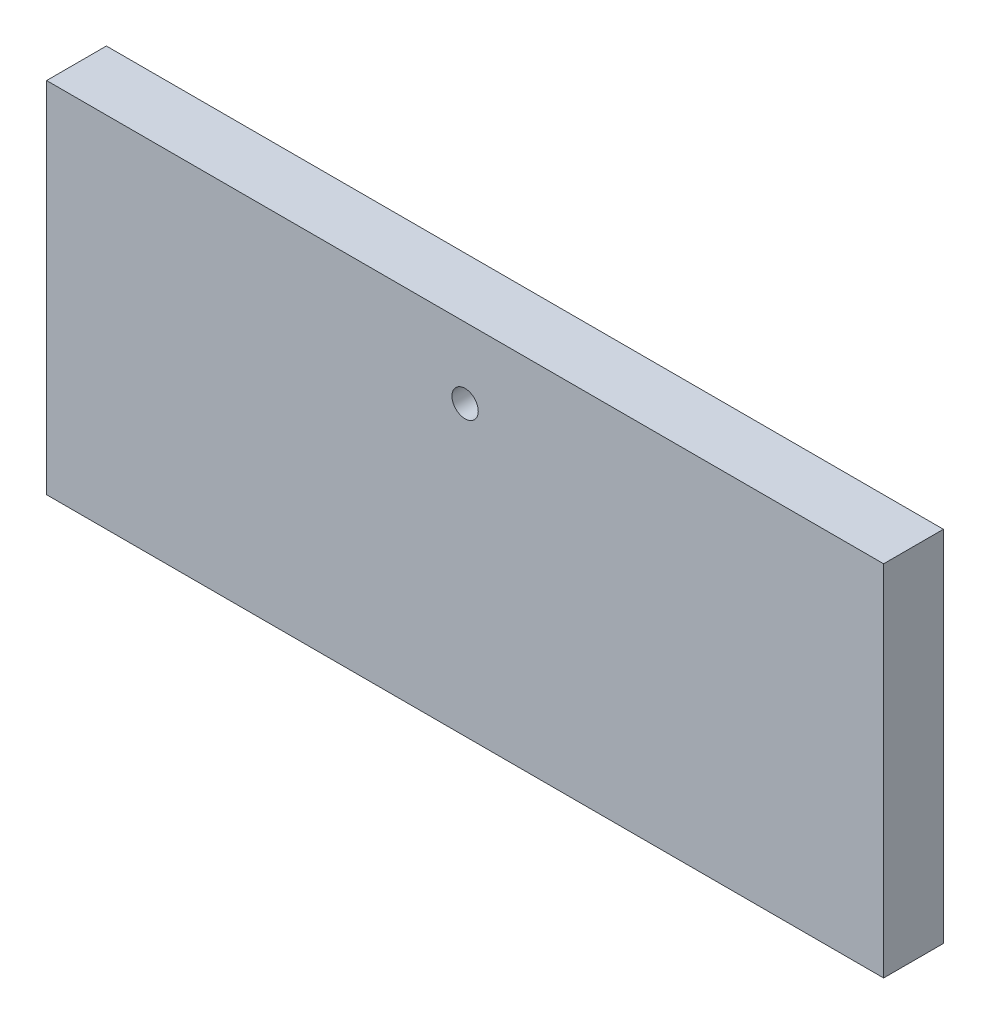
ISO-10303-21;
HEADER;
FILE_DESCRIPTION(('STEP AP214'),'2;1');
FILE_NAME('part.step','',(''),(''),'','','');
FILE_SCHEMA(('AUTOMOTIVE_DESIGN { 1 0 10303 214 1 1 1 1 }'));
ENDSEC;
DATA;
#1=APPLICATION_CONTEXT('core data for automotive mechanical design processes');
#2=APPLICATION_PROTOCOL_DEFINITION('international standard','automotive_design',2000,#1);
#3=PRODUCT_CONTEXT('',#1,'mechanical');
#4=PRODUCT('Part','Part','',(#3));
#5=PRODUCT_RELATED_PRODUCT_CATEGORY('part','',(#4));
#6=PRODUCT_DEFINITION_FORMATION('','',#4);
#7=PRODUCT_DEFINITION_CONTEXT('part definition',#1,'design');
#8=PRODUCT_DEFINITION('design','',#6,#7);
#9=PRODUCT_DEFINITION_SHAPE('','',#8);
#10=(LENGTH_UNIT() NAMED_UNIT(*) SI_UNIT(.MILLI.,.METRE.));
#11=(NAMED_UNIT(*) PLANE_ANGLE_UNIT() SI_UNIT($,.RADIAN.));
#12=(NAMED_UNIT(*) SI_UNIT($,.STERADIAN.) SOLID_ANGLE_UNIT());
#13=UNCERTAINTY_MEASURE_WITH_UNIT(LENGTH_MEASURE(1.E-05),#10,'distance_accuracy_value','');
#14=(GEOMETRIC_REPRESENTATION_CONTEXT(3) GLOBAL_UNCERTAINTY_ASSIGNED_CONTEXT((#13)) GLOBAL_UNIT_ASSIGNED_CONTEXT((#10,
#11,#12)) REPRESENTATION_CONTEXT('',''));
#15=CARTESIAN_POINT('',(0.,0.,0.));
#16=DIRECTION('',(0.,0.,1.));
#17=DIRECTION('',(1.,0.,0.));
#18=AXIS2_PLACEMENT_3D('',#15,#16,#17);
#19=CARTESIAN_POINT('',(0.,0.,25.));
#20=DIRECTION('',(0.,0.,-1.));
#21=DIRECTION('',(-1.,0.,0.));
#22=AXIS2_PLACEMENT_3D('',#19,#20,#21);
#23=PLANE('',#22);
#24=DIRECTION('',(0.,-1.,0.));
#25=VECTOR('',#24,1.);
#26=CARTESIAN_POINT('',(-350.,0.,25.));
#27=LINE('',#26,#25);
#28=CARTESIAN_POINT('',(-350.,300.,25.));
#29=VERTEX_POINT('',#28);
#30=CARTESIAN_POINT('',(-350.,0.,25.));
#31=VERTEX_POINT('',#30);
#32=EDGE_CURVE('E84',#29,#31,#27,.T.);
#33=ORIENTED_EDGE('',*,*,#32,.T.);
#34=DIRECTION('',(1.,0.,0.));
#35=VECTOR('',#34,1.);
#36=CARTESIAN_POINT('',(-350.,0.,25.));
#37=LINE('',#36,#35);
#38=CARTESIAN_POINT('',(350.,0.,25.));
#39=VERTEX_POINT('',#38);
#40=EDGE_CURVE('E79',#31,#39,#37,.T.);
#41=ORIENTED_EDGE('',*,*,#40,.T.);
#42=DIRECTION('',(0.,1.,0.));
#43=VECTOR('',#42,1.);
#44=CARTESIAN_POINT('',(350.,0.,25.));
#45=LINE('',#44,#43);
#46=CARTESIAN_POINT('',(350.,300.,25.));
#47=VERTEX_POINT('',#46);
#48=EDGE_CURVE('E82',#39,#47,#45,.T.);
#49=ORIENTED_EDGE('',*,*,#48,.T.);
#50=DIRECTION('',(-1.,0.,0.));
#51=VECTOR('',#50,1.);
#52=CARTESIAN_POINT('',(-350.,300.,25.));
#53=LINE('',#52,#51);
#54=EDGE_CURVE('E49',#47,#29,#53,.T.);
#55=ORIENTED_EDGE('',*,*,#54,.T.);
#56=EDGE_LOOP('',(#33,#41,#49,#55));
#57=FACE_BOUND('',#56,.T.);
#58=CARTESIAN_POINT('',(0.,241.,25.));
#59=DIRECTION('',(0.,0.,1.));
#60=DIRECTION('',(1.,0.,0.));
#61=AXIS2_PLACEMENT_3D('',#58,#59,#60);
#62=CIRCLE('',#61,11.);
#63=CARTESIAN_POINT('',(11.,241.,25.));
#64=VERTEX_POINT('',#63);
#65=EDGE_CURVE('E99',#64,#64,#62,.T.);
#66=ORIENTED_EDGE('',*,*,#65,.F.);
#67=EDGE_LOOP('',(#66));
#68=FACE_BOUND('',#67,.T.);
#69=ADVANCED_FACE('F32',(#57,#68),#23,.F.);
#70=CARTESIAN_POINT('',(0.,0.,-25.));
#71=DIRECTION('',(0.,0.,-1.));
#72=DIRECTION('',(-1.,0.,0.));
#73=AXIS2_PLACEMENT_3D('',#70,#71,#72);
#74=PLANE('',#73);
#75=DIRECTION('',(0.,-1.,0.));
#76=VECTOR('',#75,1.);
#77=CARTESIAN_POINT('',(-350.,0.,-25.));
#78=LINE('',#77,#76);
#79=CARTESIAN_POINT('',(-350.,300.,-25.));
#80=VERTEX_POINT('',#79);
#81=CARTESIAN_POINT('',(-350.,0.,-25.));
#82=VERTEX_POINT('',#81);
#83=EDGE_CURVE('E96',#80,#82,#78,.T.);
#84=ORIENTED_EDGE('',*,*,#83,.F.);
#85=DIRECTION('',(-1.,0.,0.));
#86=VECTOR('',#85,1.);
#87=CARTESIAN_POINT('',(-350.,300.,-25.));
#88=LINE('',#87,#86);
#89=CARTESIAN_POINT('',(350.,300.,-25.));
#90=VERTEX_POINT('',#89);
#91=EDGE_CURVE('E72',#90,#80,#88,.T.);
#92=ORIENTED_EDGE('',*,*,#91,.F.);
#93=DIRECTION('',(0.,1.,0.));
#94=VECTOR('',#93,1.);
#95=CARTESIAN_POINT('',(350.,0.,-25.));
#96=LINE('',#95,#94);
#97=CARTESIAN_POINT('',(350.,0.,-25.));
#98=VERTEX_POINT('',#97);
#99=EDGE_CURVE('E66',#98,#90,#96,.T.);
#100=ORIENTED_EDGE('',*,*,#99,.F.);
#101=DIRECTION('',(1.,0.,0.));
#102=VECTOR('',#101,1.);
#103=CARTESIAN_POINT('',(-350.,0.,-25.));
#104=LINE('',#103,#102);
#105=EDGE_CURVE('E88',#82,#98,#104,.T.);
#106=ORIENTED_EDGE('',*,*,#105,.F.);
#107=EDGE_LOOP('',(#84,#92,#100,#106));
#108=FACE_BOUND('',#107,.T.);
#109=CARTESIAN_POINT('',(0.,241.,-25.));
#110=DIRECTION('',(0.,0.,1.));
#111=DIRECTION('',(1.,0.,0.));
#112=AXIS2_PLACEMENT_3D('',#109,#110,#111);
#113=CIRCLE('',#112,11.);
#114=CARTESIAN_POINT('',(11.,241.,-25.));
#115=VERTEX_POINT('',#114);
#116=EDGE_CURVE('E113',#115,#115,#113,.T.);
#117=ORIENTED_EDGE('',*,*,#116,.T.);
#118=EDGE_LOOP('',(#117));
#119=FACE_BOUND('',#118,.T.);
#120=ADVANCED_FACE('F107',(#108,#119),#74,.T.);
#121=CARTESIAN_POINT('',(-350.,0.,25.));
#122=DIRECTION('',(1.,0.,0.));
#123=DIRECTION('',(0.,0.,-1.));
#124=AXIS2_PLACEMENT_3D('',#121,#122,#123);
#125=PLANE('',#124);
#126=ORIENTED_EDGE('',*,*,#83,.T.);
#127=DIRECTION('',(0.,0.,-1.));
#128=VECTOR('',#127,1.);
#129=CARTESIAN_POINT('',(-350.,0.,25.));
#130=LINE('',#129,#128);
#131=EDGE_CURVE('E11',#31,#82,#130,.T.);
#132=ORIENTED_EDGE('',*,*,#131,.F.);
#133=ORIENTED_EDGE('',*,*,#32,.F.);
#134=DIRECTION('',(0.,0.,-1.));
#135=VECTOR('',#134,1.);
#136=CARTESIAN_POINT('',(-350.,300.,25.));
#137=LINE('',#136,#135);
#138=EDGE_CURVE('E92',#29,#80,#137,.T.);
#139=ORIENTED_EDGE('',*,*,#138,.T.);
#140=EDGE_LOOP('',(#126,#132,#133,#139));
#141=FACE_BOUND('',#140,.T.);
#142=ADVANCED_FACE('F34',(#141),#125,.F.);
#143=CARTESIAN_POINT('',(-350.,0.,25.));
#144=DIRECTION('',(0.,1.,0.));
#145=DIRECTION('',(0.,0.,1.));
#146=AXIS2_PLACEMENT_3D('',#143,#144,#145);
#147=PLANE('',#146);
#148=ORIENTED_EDGE('',*,*,#105,.T.);
#149=DIRECTION('',(0.,0.,-1.));
#150=VECTOR('',#149,1.);
#151=CARTESIAN_POINT('',(350.,0.,25.));
#152=LINE('',#151,#150);
#153=EDGE_CURVE('E41',#39,#98,#152,.T.);
#154=ORIENTED_EDGE('',*,*,#153,.F.);
#155=ORIENTED_EDGE('',*,*,#40,.F.);
#156=ORIENTED_EDGE('',*,*,#131,.T.);
#157=EDGE_LOOP('',(#148,#154,#155,#156));
#158=FACE_BOUND('',#157,.T.);
#159=ADVANCED_FACE('F87',(#158),#147,.F.);
#160=CARTESIAN_POINT('',(350.,0.,25.));
#161=DIRECTION('',(-1.,0.,0.));
#162=DIRECTION('',(0.,0.,1.));
#163=AXIS2_PLACEMENT_3D('',#160,#161,#162);
#164=PLANE('',#163);
#165=ORIENTED_EDGE('',*,*,#99,.T.);
#166=DIRECTION('',(0.,0.,-1.));
#167=VECTOR('',#166,1.);
#168=CARTESIAN_POINT('',(350.,300.,25.));
#169=LINE('',#168,#167);
#170=EDGE_CURVE('E89',#47,#90,#169,.T.);
#171=ORIENTED_EDGE('',*,*,#170,.F.);
#172=ORIENTED_EDGE('',*,*,#48,.F.);
#173=ORIENTED_EDGE('',*,*,#153,.T.);
#174=EDGE_LOOP('',(#165,#171,#172,#173));
#175=FACE_BOUND('',#174,.T.);
#176=ADVANCED_FACE('F90',(#175),#164,.F.);
#177=CARTESIAN_POINT('',(-350.,300.,25.));
#178=DIRECTION('',(0.,-1.,0.));
#179=DIRECTION('',(0.,0.,-1.));
#180=AXIS2_PLACEMENT_3D('',#177,#178,#179);
#181=PLANE('',#180);
#182=ORIENTED_EDGE('',*,*,#91,.T.);
#183=ORIENTED_EDGE('',*,*,#138,.F.);
#184=ORIENTED_EDGE('',*,*,#54,.F.);
#185=ORIENTED_EDGE('',*,*,#170,.T.);
#186=EDGE_LOOP('',(#182,#183,#184,#185));
#187=FACE_BOUND('',#186,.T.);
#188=ADVANCED_FACE('F104',(#187),#181,.F.);
#189=CARTESIAN_POINT('',(0.,241.,25.));
#190=DIRECTION('',(0.,0.,-1.));
#191=DIRECTION('',(-1.,0.,0.));
#192=AXIS2_PLACEMENT_3D('',#189,#190,#191);
#193=CYLINDRICAL_SURFACE('',#192,11.);
#194=ORIENTED_EDGE('',*,*,#65,.T.);
#195=EDGE_LOOP('',(#194));
#196=FACE_BOUND('',#195,.T.);
#197=ORIENTED_EDGE('',*,*,#116,.F.);
#198=EDGE_LOOP('',(#197));
#199=FACE_BOUND('',#198,.T.);
#200=ADVANCED_FACE('F117',(#196,#199),#193,.F.);
#201=CLOSED_SHELL('',(#69,#120,#142,#159,#176,#188,#200));
#202=MANIFOLD_SOLID_BREP('B2',#201);
#203=ADVANCED_BREP_SHAPE_REPRESENTATION('',(#18,#202),#14);
#204=SHAPE_DEFINITION_REPRESENTATION(#9,#203);
ENDSEC;
END-ISO-10303-21;
